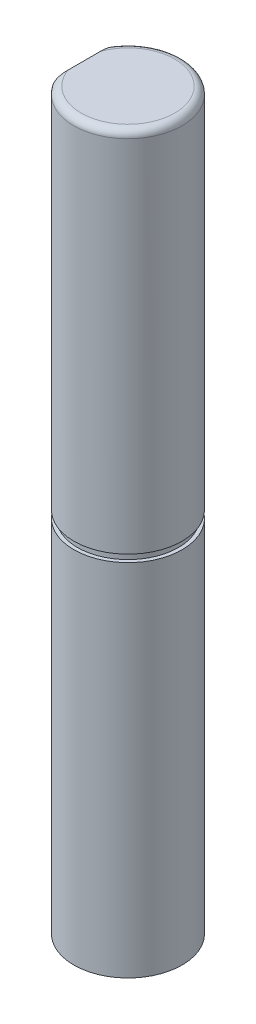
ISO-10303-21;
HEADER;
FILE_DESCRIPTION(('STEP AP214'),'2;1');
FILE_NAME('part.step','',(''),(''),'','','');
FILE_SCHEMA(('AUTOMOTIVE_DESIGN { 1 0 10303 214 1 1 1 1 }'));
ENDSEC;
DATA;
#1=APPLICATION_CONTEXT('core data for automotive mechanical design processes');
#2=APPLICATION_PROTOCOL_DEFINITION('international standard','automotive_design',2000,#1);
#3=PRODUCT_CONTEXT('',#1,'mechanical');
#4=PRODUCT('Part','Part','',(#3));
#5=PRODUCT_RELATED_PRODUCT_CATEGORY('part','',(#4));
#6=PRODUCT_DEFINITION_FORMATION('','',#4);
#7=PRODUCT_DEFINITION_CONTEXT('part definition',#1,'design');
#8=PRODUCT_DEFINITION('design','',#6,#7);
#9=PRODUCT_DEFINITION_SHAPE('','',#8);
#10=(LENGTH_UNIT() NAMED_UNIT(*) SI_UNIT(.MILLI.,.METRE.));
#11=(NAMED_UNIT(*) PLANE_ANGLE_UNIT() SI_UNIT($,.RADIAN.));
#12=(NAMED_UNIT(*) SI_UNIT($,.STERADIAN.) SOLID_ANGLE_UNIT());
#13=UNCERTAINTY_MEASURE_WITH_UNIT(LENGTH_MEASURE(1.E-05),#10,'distance_accuracy_value','');
#14=(GEOMETRIC_REPRESENTATION_CONTEXT(3) GLOBAL_UNCERTAINTY_ASSIGNED_CONTEXT((#13)) GLOBAL_UNIT_ASSIGNED_CONTEXT((#10,
#11,#12)) REPRESENTATION_CONTEXT('',''));
#15=CARTESIAN_POINT('',(0.,0.,0.));
#16=DIRECTION('',(0.,0.,1.));
#17=DIRECTION('',(1.,0.,0.));
#18=AXIS2_PLACEMENT_3D('',#15,#16,#17);
#19=CARTESIAN_POINT('',(0.,20.,0.));
#20=DIRECTION('',(0.,-1.,0.));
#21=DIRECTION('',(0.,0.,-1.));
#22=AXIS2_PLACEMENT_3D('',#19,#20,#21);
#23=CYLINDRICAL_SURFACE('',#22,1.475);
#24=CARTESIAN_POINT('',(0.,0.,0.));
#25=DIRECTION('',(0.,1.,0.));
#26=DIRECTION('',(0.,0.,1.));
#27=AXIS2_PLACEMENT_3D('',#24,#25,#26);
#28=CIRCLE('',#27,1.475);
#29=CARTESIAN_POINT('',(0.,0.,1.475));
#30=VERTEX_POINT('',#29);
#31=EDGE_CURVE('E103',#30,#30,#28,.T.);
#32=ORIENTED_EDGE('',*,*,#31,.T.);
#33=EDGE_LOOP('',(#32));
#34=FACE_BOUND('',#33,.T.);
#35=CARTESIAN_POINT('',(0.,9.8,0.));
#36=DIRECTION('',(0.,1.,0.));
#37=DIRECTION('',(0.,0.,1.));
#38=AXIS2_PLACEMENT_3D('',#35,#36,#37);
#39=CIRCLE('',#38,1.475);
#40=CARTESIAN_POINT('',(0.,9.8,1.475));
#41=VERTEX_POINT('',#40);
#42=EDGE_CURVE('E100',#41,#41,#39,.T.);
#43=ORIENTED_EDGE('',*,*,#42,.F.);
#44=EDGE_LOOP('',(#43));
#45=FACE_BOUND('',#44,.T.);
#46=ADVANCED_FACE('F42',(#34,#45),#23,.T.);
#47=CARTESIAN_POINT('',(0.,0.,0.));
#48=DIRECTION('',(0.,1.,0.));
#49=DIRECTION('',(0.,0.,1.));
#50=AXIS2_PLACEMENT_3D('',#47,#48,#49);
#51=PLANE('',#50);
#52=ORIENTED_EDGE('',*,*,#31,.F.);
#53=EDGE_LOOP('',(#52));
#54=FACE_BOUND('',#53,.T.);
#55=ADVANCED_FACE('F135',(#54),#51,.F.);
#56=CARTESIAN_POINT('',(0.,9.8,0.));
#57=DIRECTION('',(0.,1.,0.));
#58=DIRECTION('',(0.,0.,1.));
#59=AXIS2_PLACEMENT_3D('',#56,#57,#58);
#60=PLANE('',#59);
#61=CARTESIAN_POINT('',(0.,9.8,0.));
#62=DIRECTION('',(0.,1.,0.));
#63=DIRECTION('',(1.,0.,0.));
#64=AXIS2_PLACEMENT_3D('',#61,#62,#63);
#65=CIRCLE('',#64,1.375);
#66=CARTESIAN_POINT('',(1.375,9.8,0.));
#67=VERTEX_POINT('',#66);
#68=EDGE_CURVE('E94',#67,#67,#65,.T.);
#69=ORIENTED_EDGE('',*,*,#68,.F.);
#70=EDGE_LOOP('',(#69));
#71=FACE_BOUND('',#70,.T.);
#72=ORIENTED_EDGE('',*,*,#42,.T.);
#73=EDGE_LOOP('',(#72));
#74=FACE_BOUND('',#73,.T.);
#75=ADVANCED_FACE('F132',(#71,#74),#60,.T.);
#76=CARTESIAN_POINT('',(0.,10.,0.));
#77=DIRECTION('',(0.,1.,0.));
#78=DIRECTION('',(0.,0.,1.));
#79=AXIS2_PLACEMENT_3D('',#76,#77,#78);
#80=PLANE('',#79);
#81=CARTESIAN_POINT('',(0.,10.,0.));
#82=DIRECTION('',(0.,1.,0.));
#83=DIRECTION('',(1.,0.,0.));
#84=AXIS2_PLACEMENT_3D('',#81,#82,#83);
#85=CIRCLE('',#84,1.375);
#86=CARTESIAN_POINT('',(1.375,10.,0.));
#87=VERTEX_POINT('',#86);
#88=EDGE_CURVE('E90',#87,#87,#85,.T.);
#89=ORIENTED_EDGE('',*,*,#88,.T.);
#90=EDGE_LOOP('',(#89));
#91=FACE_BOUND('',#90,.T.);
#92=CARTESIAN_POINT('',(0.,10.,0.));
#93=DIRECTION('',(0.,1.,0.));
#94=DIRECTION('',(0.,0.,1.));
#95=AXIS2_PLACEMENT_3D('',#92,#93,#94);
#96=CIRCLE('',#95,1.475);
#97=CARTESIAN_POINT('',(0.,10.,1.475));
#98=VERTEX_POINT('',#97);
#99=EDGE_CURVE('E97',#98,#98,#96,.T.);
#100=ORIENTED_EDGE('',*,*,#99,.F.);
#101=EDGE_LOOP('',(#100));
#102=FACE_BOUND('',#101,.T.);
#103=ADVANCED_FACE('F130',(#91,#102),#80,.F.);
#104=CARTESIAN_POINT('',(0.,9.8,0.));
#105=DIRECTION('',(0.,1.,0.));
#106=DIRECTION('',(0.,0.,1.));
#107=AXIS2_PLACEMENT_3D('',#104,#105,#106);
#108=CYLINDRICAL_SURFACE('',#107,1.375);
#109=ORIENTED_EDGE('',*,*,#68,.T.);
#110=EDGE_LOOP('',(#109));
#111=FACE_BOUND('',#110,.T.);
#112=ORIENTED_EDGE('',*,*,#88,.F.);
#113=EDGE_LOOP('',(#112));
#114=FACE_BOUND('',#113,.T.);
#115=ADVANCED_FACE('F125',(#111,#114),#108,.T.);
#116=CARTESIAN_POINT('',(0.,20.,0.));
#117=DIRECTION('',(0.,1.,0.));
#118=DIRECTION('',(0.,0.,1.));
#119=AXIS2_PLACEMENT_3D('',#116,#117,#118);
#120=PLANE('',#119);
#121=DIRECTION('',(0.,0.,-1.));
#122=VECTOR('',#121,1.);
#123=CARTESIAN_POINT('',(-1.195,20.,-0.864638652848693));
#124=LINE('',#123,#122);
#125=CARTESIAN_POINT('',(-1.195,20.,0.444522215417859));
#126=VERTEX_POINT('',#125);
#127=CARTESIAN_POINT('',(-1.195,20.,-0.444522215417859));
#128=VERTEX_POINT('',#127);
#129=EDGE_CURVE('E80',#126,#128,#124,.T.);
#130=ORIENTED_EDGE('',*,*,#129,.F.);
#131=CARTESIAN_POINT('',(0.,20.,0.));
#132=DIRECTION('',(0.,1.,0.));
#133=DIRECTION('',(0.,0.,1.));
#134=AXIS2_PLACEMENT_3D('',#131,#132,#133);
#135=CIRCLE('',#134,1.275);
#136=EDGE_CURVE('E108',#126,#128,#135,.T.);
#137=ORIENTED_EDGE('',*,*,#136,.T.);
#138=EDGE_LOOP('',(#130,#137));
#139=FACE_BOUND('',#138,.T.);
#140=ADVANCED_FACE('F129',(#139),#120,.T.);
#141=DIRECTION('',(0.,1.,0.));
#142=VECTOR('',#141,1.);
#143=CARTESIAN_POINT('',(-1.195,12.58,-0.864638652848693));
#144=LINE('',#143,#142);
#145=CARTESIAN_POINT('',(-1.195,12.58,-0.864638652848693));
#146=VERTEX_POINT('',#145);
#147=CARTESIAN_POINT('',(-1.195,19.8,-0.864638652848693));
#148=VERTEX_POINT('',#147);
#149=EDGE_CURVE('E85',#146,#148,#144,.T.);
#150=ORIENTED_EDGE('',*,*,#149,.T.);
#151=CARTESIAN_POINT('',(0.,19.8,0.));
#152=DIRECTION('',(0.,1.,0.));
#153=DIRECTION('',(0.,0.,1.));
#154=AXIS2_PLACEMENT_3D('',#151,#152,#153);
#155=CIRCLE('',#154,1.475);
#156=CARTESIAN_POINT('',(-1.195,19.8,0.864638652848693));
#157=VERTEX_POINT('',#156);
#158=EDGE_CURVE('E12',#148,#157,#155,.F.);
#159=ORIENTED_EDGE('',*,*,#158,.T.);
#160=DIRECTION('',(0.,1.,0.));
#161=VECTOR('',#160,1.);
#162=CARTESIAN_POINT('',(-1.195,12.58,0.864638652848693));
#163=LINE('',#162,#161);
#164=CARTESIAN_POINT('',(-1.195,12.58,0.864638652848693));
#165=VERTEX_POINT('',#164);
#166=EDGE_CURVE('E83',#165,#157,#163,.T.);
#167=ORIENTED_EDGE('',*,*,#166,.F.);
#168=CARTESIAN_POINT('',(0.,12.58,0.));
#169=DIRECTION('',(0.,1.,0.));
#170=DIRECTION('',(0.,0.,1.));
#171=AXIS2_PLACEMENT_3D('',#168,#169,#170);
#172=CIRCLE('',#171,1.475);
#173=EDGE_CURVE('E76',#146,#165,#172,.T.);
#174=ORIENTED_EDGE('',*,*,#173,.F.);
#175=EDGE_LOOP('',(#150,#159,#167,#174));
#176=FACE_BOUND('',#175,.T.);
#177=ORIENTED_EDGE('',*,*,#99,.T.);
#178=EDGE_LOOP('',(#177));
#179=FACE_BOUND('',#178,.T.);
#180=ADVANCED_FACE('F87',(#176,#179),#23,.T.);
#181=CARTESIAN_POINT('',(-1.195,12.58,-0.864638652848693));
#182=DIRECTION('',(1.,0.,0.));
#183=DIRECTION('',(0.,0.,-1.));
#184=AXIS2_PLACEMENT_3D('',#181,#182,#183);
#185=PLANE('',#184);
#186=ORIENTED_EDGE('',*,*,#129,.T.);
#187=CARTESIAN_POINT('',(-1.195,20.,-0.444522215417859));
#188=CARTESIAN_POINT('',(-1.195,19.9999934264894,-0.463058923727068));
#189=CARTESIAN_POINT('',(-1.195,19.9996858965175,-0.481607786763137));
#190=CARTESIAN_POINT('',(-1.195,19.9982166992433,-0.518746414219055));
#191=CARTESIAN_POINT('',(-1.195,19.9970515121272,-0.537336031508759));
#192=CARTESIAN_POINT('',(-1.195,19.9935926916804,-0.574612730106761));
#193=CARTESIAN_POINT('',(-1.195,19.9912873808908,-0.593298796600268));
#194=CARTESIAN_POINT('',(-1.195,19.9852200668943,-0.630411077399188));
#195=CARTESIAN_POINT('',(-1.195,19.9814607405826,-0.648837705104182));
#196=CARTESIAN_POINT('',(-1.195,19.9733987426006,-0.680087196699138));
#197=CARTESIAN_POINT('',(-1.195,19.9695480391083,-0.693025343702785));
#198=CARTESIAN_POINT('',(-1.195,19.9606940644304,-0.71850090322006));
#199=CARTESIAN_POINT('',(-1.195,19.9556915631839,-0.731038577089803));
#200=CARTESIAN_POINT('',(-1.195,19.9442584732299,-0.755585823140465));
#201=CARTESIAN_POINT('',(-1.195,19.9378162022712,-0.76759005299898));
#202=CARTESIAN_POINT('',(-1.195,19.9232581348589,-0.790550720375596));
#203=CARTESIAN_POINT('',(-1.195,19.9151452367251,-0.801508925056344));
#204=CARTESIAN_POINT('',(-1.195,19.9002330785259,-0.818112324013363));
#205=CARTESIAN_POINT('',(-1.195,19.8939953616729,-0.824259591685747));
#206=CARTESIAN_POINT('',(-1.195,19.8806859198728,-0.8355843659556));
#207=CARTESIAN_POINT('',(-1.195,19.8736149646097,-0.840762756261668));
#208=CARTESIAN_POINT('',(-1.195,19.8598230624195,-0.849132951853403));
#209=CARTESIAN_POINT('',(-1.195,19.853213804918,-0.852507420753884));
#210=CARTESIAN_POINT('',(-1.195,19.8395300483212,-0.858108570453493));
#211=CARTESIAN_POINT('',(-1.195,19.8324566287599,-0.860337815047227));
#212=CARTESIAN_POINT('',(-1.195,19.8211033458849,-0.862808048025684));
#213=CARTESIAN_POINT('',(-1.195,19.8169164069109,-0.863491460444375));
#214=CARTESIAN_POINT('',(-1.195,19.8084873977756,-0.864407948337497));
#215=CARTESIAN_POINT('',(-1.195,19.8042452546406,-0.864640349979884));
#216=CARTESIAN_POINT('',(-1.195,19.800000000002,-0.864638652857977));
#217=B_SPLINE_CURVE_WITH_KNOTS('',3,(#187,#188,#189,#190,#191,#192,#193,#194,#195,#196,#197,
#198,#199,#200,#201,#202,#203,#204,#205,#206,#207,#208,#209,#210,#211,#212,#213,#214,#215,#216),
.UNSPECIFIED.,.F.,.F.,(4,2,2,2,2,2,2,2,2,2,2,2,2,2,4),(0.,0.0556265036455667,0.111482579621028,
0.167922980802626,0.224259964000889,0.264714399811614,0.30514187126505,0.345910115503078,
0.386608219196494,0.412808662968492,0.438985091679982,0.46116061790881,0.483286281418708,
0.495991044755102,0.508714775056933),.UNSPECIFIED.);
#218=EDGE_CURVE('E51',#128,#148,#217,.T.);
#219=ORIENTED_EDGE('',*,*,#218,.T.);
#220=ORIENTED_EDGE('',*,*,#149,.F.);
#221=DIRECTION('',(0.,0.,-1.));
#222=VECTOR('',#221,1.);
#223=CARTESIAN_POINT('',(-1.195,12.58,-0.864638652848693));
#224=LINE('',#223,#222);
#225=EDGE_CURVE('E79',#165,#146,#224,.T.);
#226=ORIENTED_EDGE('',*,*,#225,.F.);
#227=ORIENTED_EDGE('',*,*,#166,.T.);
#228=CARTESIAN_POINT('',(-1.195,19.8,0.864638652848693));
#229=CARTESIAN_POINT('',(-1.195,19.8079851811121,0.864662631258414));
#230=CARTESIAN_POINT('',(-1.195,19.815941364251,0.863824655339803));
#231=CARTESIAN_POINT('',(-1.195,19.8314564339703,0.860640882709783));
#232=CARTESIAN_POINT('',(-1.195,19.8390188085626,0.858312333316324));
#233=CARTESIAN_POINT('',(-1.195,19.8535696311346,0.85236723438612));
#234=CARTESIAN_POINT('',(-1.195,19.8605603211025,0.848756045699661));
#235=CARTESIAN_POINT('',(-1.195,19.8739161250488,0.840496870077358));
#236=CARTESIAN_POINT('',(-1.195,19.8802792819885,0.835845778804549));
#237=CARTESIAN_POINT('',(-1.195,19.8953385211503,0.823227000585544));
#238=CARTESIAN_POINT('',(-1.195,19.9036160927114,0.814761868163851));
#239=CARTESIAN_POINT('',(-1.195,19.9187490835888,0.796661228030928));
#240=CARTESIAN_POINT('',(-1.195,19.9256022411916,0.787023896958548));
#241=CARTESIAN_POINT('',(-1.195,19.9422020589162,0.760336012179803));
#242=CARTESIAN_POINT('',(-1.195,19.9508519429983,0.742609131888408));
#243=CARTESIAN_POINT('',(-1.195,19.9655278479548,0.706025423684589));
#244=CARTESIAN_POINT('',(-1.195,19.9715350520243,0.687161546432031));
#245=CARTESIAN_POINT('',(-1.195,19.9813025275848,0.649587627147778));
#246=CARTESIAN_POINT('',(-1.195,19.9851346296941,0.630895660443666));
#247=CARTESIAN_POINT('',(-1.195,19.9913025780512,0.593243438660856));
#248=CARTESIAN_POINT('',(-1.195,19.993635745105,0.57428276475596));
#249=CARTESIAN_POINT('',(-1.195,19.9970859062699,0.536830824230824));
#250=CARTESIAN_POINT('',(-1.195,19.9982372044822,0.518342489672531));
#251=CARTESIAN_POINT('',(-1.195,19.9996893482194,0.481406280827398));
#252=CARTESIAN_POINT('',(-1.195,19.9999936512415,0.462958550122727));
#253=CARTESIAN_POINT('',(-1.195,20.,0.44452221541786));
#254=B_SPLINE_CURVE_WITH_KNOTS('',3,(#228,#229,#230,#231,#232,#233,#234,#235,#236,#237,#238,
#239,#240,#241,#242,#243,#244,#245,#246,#247,#248,#249,#250,#251,#252,#253),.UNSPECIFIED.,.F.,
.F.,(4,2,2,2,2,2,2,2,2,2,2,2,4),(0.,0.0238657410463062,0.047460205759405,0.0709571947966831,
0.0945252869254218,0.129843336711912,0.165217043890547,0.224059117499443,0.283313641198127,
0.340476499221092,0.397741247848331,0.453292375999602,0.508616405395466),.UNSPECIFIED.);
#255=EDGE_CURVE('E111',#157,#126,#254,.T.);
#256=ORIENTED_EDGE('',*,*,#255,.T.);
#257=EDGE_LOOP('',(#186,#219,#220,#226,#227,#256));
#258=FACE_BOUND('',#257,.T.);
#259=ADVANCED_FACE('F82',(#258),#185,.F.);
#260=CARTESIAN_POINT('',(0.,12.58,0.));
#261=DIRECTION('',(0.,1.,0.));
#262=DIRECTION('',(0.,0.,1.));
#263=AXIS2_PLACEMENT_3D('',#260,#261,#262);
#264=PLANE('',#263);
#265=ORIENTED_EDGE('',*,*,#173,.T.);
#266=ORIENTED_EDGE('',*,*,#225,.T.);
#267=EDGE_LOOP('',(#265,#266));
#268=FACE_BOUND('',#267,.T.);
#269=ADVANCED_FACE('F78',(#268),#264,.T.);
#270=CARTESIAN_POINT('',(0.,19.8,0.));
#271=DIRECTION('',(0.,1.,0.));
#272=DIRECTION('',(0.,0.,1.));
#273=AXIS2_PLACEMENT_3D('',#270,#271,#272);
#274=TOROIDAL_SURFACE('',#273,1.275,0.2);
#275=ORIENTED_EDGE('',*,*,#255,.F.);
#276=ORIENTED_EDGE('',*,*,#158,.F.);
#277=ORIENTED_EDGE('',*,*,#218,.F.);
#278=ORIENTED_EDGE('',*,*,#136,.F.);
#279=EDGE_LOOP('',(#275,#276,#277,#278));
#280=FACE_BOUND('',#279,.T.);
#281=ADVANCED_FACE('F44',(#280),#274,.T.);
#282=CLOSED_SHELL('',(#46,#55,#75,#103,#115,#140,#180,#259,#269,#281));
#283=MANIFOLD_SOLID_BREP('B2',#282);
#284=ADVANCED_BREP_SHAPE_REPRESENTATION('',(#18,#283),#14);
#285=SHAPE_DEFINITION_REPRESENTATION(#9,#284);
ENDSEC;
END-ISO-10303-21;
